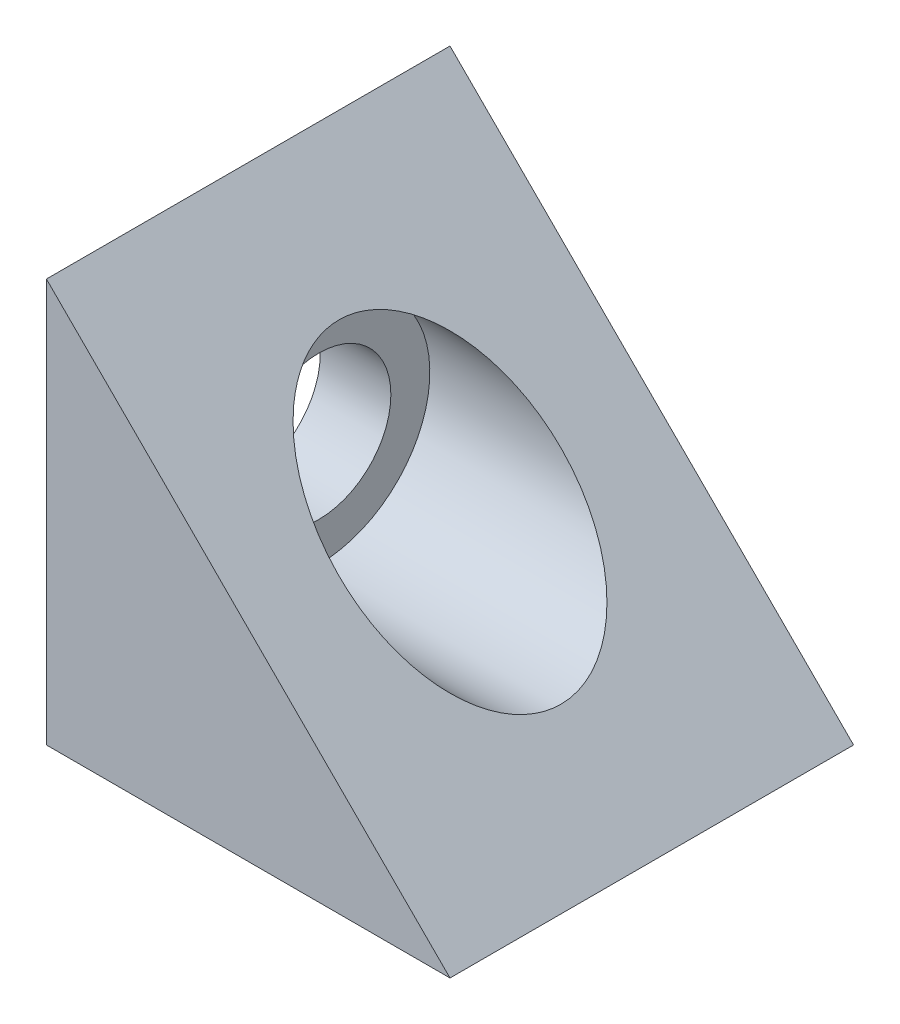
ISO-10303-21;
HEADER;
FILE_DESCRIPTION(('STEP AP214'),'2;1');
FILE_NAME('part.step','',(''),(''),'','','');
FILE_SCHEMA(('AUTOMOTIVE_DESIGN { 1 0 10303 214 1 1 1 1 }'));
ENDSEC;
DATA;
#1=APPLICATION_CONTEXT('core data for automotive mechanical design processes');
#2=APPLICATION_PROTOCOL_DEFINITION('international standard','automotive_design',2000,#1);
#3=PRODUCT_CONTEXT('',#1,'mechanical');
#4=PRODUCT('Part','Part','',(#3));
#5=PRODUCT_RELATED_PRODUCT_CATEGORY('part','',(#4));
#6=PRODUCT_DEFINITION_FORMATION('','',#4);
#7=PRODUCT_DEFINITION_CONTEXT('part definition',#1,'design');
#8=PRODUCT_DEFINITION('design','',#6,#7);
#9=PRODUCT_DEFINITION_SHAPE('','',#8);
#10=(LENGTH_UNIT() NAMED_UNIT(*) SI_UNIT(.MILLI.,.METRE.));
#11=(NAMED_UNIT(*) PLANE_ANGLE_UNIT() SI_UNIT($,.RADIAN.));
#12=(NAMED_UNIT(*) SI_UNIT($,.STERADIAN.) SOLID_ANGLE_UNIT());
#13=UNCERTAINTY_MEASURE_WITH_UNIT(LENGTH_MEASURE(1.E-05),#10,'distance_accuracy_value','');
#14=(GEOMETRIC_REPRESENTATION_CONTEXT(3) GLOBAL_UNCERTAINTY_ASSIGNED_CONTEXT((#13)) GLOBAL_UNIT_ASSIGNED_CONTEXT((#10,
#11,#12)) REPRESENTATION_CONTEXT('',''));
#15=CARTESIAN_POINT('',(0.,0.,0.));
#16=DIRECTION('',(0.,0.,1.));
#17=DIRECTION('',(1.,0.,0.));
#18=AXIS2_PLACEMENT_3D('',#15,#16,#17);
#19=CARTESIAN_POINT('',(20.,0.,-10.));
#20=DIRECTION('',(0.,-1.,0.));
#21=DIRECTION('',(1.,0.,0.));
#22=AXIS2_PLACEMENT_3D('',#19,#20,#21);
#23=PLANE('',#22);
#24=DIRECTION('',(1.,0.,0.));
#25=VECTOR('',#24,1.);
#26=CARTESIAN_POINT('',(20.,0.,10.));
#27=LINE('',#26,#25);
#28=CARTESIAN_POINT('',(0.,0.,10.));
#29=VERTEX_POINT('',#28);
#30=CARTESIAN_POINT('',(20.,0.,10.));
#31=VERTEX_POINT('',#30);
#32=EDGE_CURVE('E91',#29,#31,#27,.T.);
#33=ORIENTED_EDGE('',*,*,#32,.F.);
#34=DIRECTION('',(0.,0.,1.));
#35=VECTOR('',#34,1.);
#36=CARTESIAN_POINT('',(0.,0.,-10.));
#37=LINE('',#36,#35);
#38=CARTESIAN_POINT('',(0.,0.,-10.));
#39=VERTEX_POINT('',#38);
#40=EDGE_CURVE('E12',#39,#29,#37,.T.);
#41=ORIENTED_EDGE('',*,*,#40,.F.);
#42=DIRECTION('',(1.,0.,0.));
#43=VECTOR('',#42,1.);
#44=CARTESIAN_POINT('',(20.,0.,-10.));
#45=LINE('',#44,#43);
#46=CARTESIAN_POINT('',(20.,0.,-10.));
#47=VERTEX_POINT('',#46);
#48=EDGE_CURVE('E80',#39,#47,#45,.T.);
#49=ORIENTED_EDGE('',*,*,#48,.T.);
#50=DIRECTION('',(0.,0.,1.));
#51=VECTOR('',#50,1.);
#52=CARTESIAN_POINT('',(20.,0.,-10.));
#53=LINE('',#52,#51);
#54=EDGE_CURVE('E69',#47,#31,#53,.T.);
#55=ORIENTED_EDGE('',*,*,#54,.T.);
#56=EDGE_LOOP('',(#33,#41,#49,#55));
#57=FACE_BOUND('',#56,.T.);
#58=ADVANCED_FACE('F34',(#57),#23,.T.);
#59=CARTESIAN_POINT('',(0.,0.,-10.));
#60=DIRECTION('',(-1.,0.,0.));
#61=DIRECTION('',(0.,0.,1.));
#62=AXIS2_PLACEMENT_3D('',#59,#60,#61);
#63=PLANE('',#62);
#64=CARTESIAN_POINT('',(0.,10.,0.));
#65=DIRECTION('',(1.,0.,0.));
#66=DIRECTION('',(0.,0.,-1.));
#67=AXIS2_PLACEMENT_3D('',#64,#65,#66);
#68=CIRCLE('',#67,3.57);
#69=CARTESIAN_POINT('',(0.,10.,-3.57));
#70=VERTEX_POINT('',#69);
#71=EDGE_CURVE('E87',#70,#70,#68,.T.);
#72=ORIENTED_EDGE('',*,*,#71,.T.);
#73=EDGE_LOOP('',(#72));
#74=FACE_BOUND('',#73,.T.);
#75=DIRECTION('',(0.,-1.,0.));
#76=VECTOR('',#75,1.);
#77=CARTESIAN_POINT('',(0.,0.,10.));
#78=LINE('',#77,#76);
#79=CARTESIAN_POINT('',(0.,20.,10.));
#80=VERTEX_POINT('',#79);
#81=EDGE_CURVE('E82',#80,#29,#78,.T.);
#82=ORIENTED_EDGE('',*,*,#81,.F.);
#83=DIRECTION('',(0.,0.,1.));
#84=VECTOR('',#83,1.);
#85=CARTESIAN_POINT('',(0.,20.,-10.));
#86=LINE('',#85,#84);
#87=CARTESIAN_POINT('',(0.,20.,-10.));
#88=VERTEX_POINT('',#87);
#89=EDGE_CURVE('E43',#88,#80,#86,.T.);
#90=ORIENTED_EDGE('',*,*,#89,.F.);
#91=DIRECTION('',(0.,-1.,0.));
#92=VECTOR('',#91,1.);
#93=CARTESIAN_POINT('',(0.,0.,-10.));
#94=LINE('',#93,#92);
#95=EDGE_CURVE('E76',#88,#39,#94,.T.);
#96=ORIENTED_EDGE('',*,*,#95,.T.);
#97=ORIENTED_EDGE('',*,*,#40,.T.);
#98=EDGE_LOOP('',(#82,#90,#96,#97));
#99=FACE_BOUND('',#98,.T.);
#100=ADVANCED_FACE('F116',(#74,#99),#63,.T.);
#101=CARTESIAN_POINT('',(0.,20.,-10.));
#102=DIRECTION('',(0.707106781186548,0.707106781186548,0.));
#103=DIRECTION('',(-0.707106781186548,0.707106781186548,0.));
#104=AXIS2_PLACEMENT_3D('',#101,#102,#103);
#105=PLANE('',#104);
#106=CARTESIAN_POINT('',(10.,10.,0.));
#107=DIRECTION('',(0.707106781186548,0.707106781186548,0.));
#108=DIRECTION('',(0.707106781186548,-0.707106781186548,0.));
#109=AXIS2_PLACEMENT_3D('',#106,#107,#108);
#110=ELLIPSE('',#109,7.77817459305202,5.5);
#111=CARTESIAN_POINT('',(15.5,4.5,0.));
#112=VERTEX_POINT('',#111);
#113=EDGE_CURVE('E37',#112,#112,#110,.T.);
#114=ORIENTED_EDGE('',*,*,#113,.F.);
#115=EDGE_LOOP('',(#114));
#116=FACE_BOUND('',#115,.T.);
#117=DIRECTION('',(-0.707106781186548,0.707106781186548,0.));
#118=VECTOR('',#117,1.);
#119=CARTESIAN_POINT('',(0.,20.,10.));
#120=LINE('',#119,#118);
#121=EDGE_CURVE('E74',#31,#80,#120,.T.);
#122=ORIENTED_EDGE('',*,*,#121,.F.);
#123=ORIENTED_EDGE('',*,*,#54,.F.);
#124=DIRECTION('',(-0.707106781186548,0.707106781186548,0.));
#125=VECTOR('',#124,1.);
#126=CARTESIAN_POINT('',(0.,20.,-10.));
#127=LINE('',#126,#125);
#128=EDGE_CURVE('E72',#47,#88,#127,.T.);
#129=ORIENTED_EDGE('',*,*,#128,.T.);
#130=ORIENTED_EDGE('',*,*,#89,.T.);
#131=EDGE_LOOP('',(#122,#123,#129,#130));
#132=FACE_BOUND('',#131,.T.);
#133=ADVANCED_FACE('F71',(#116,#132),#105,.T.);
#134=CARTESIAN_POINT('',(0.,0.,-10.));
#135=DIRECTION('',(0.,0.,-1.));
#136=DIRECTION('',(-1.,0.,0.));
#137=AXIS2_PLACEMENT_3D('',#134,#135,#136);
#138=PLANE('',#137);
#139=ORIENTED_EDGE('',*,*,#48,.F.);
#140=ORIENTED_EDGE('',*,*,#95,.F.);
#141=ORIENTED_EDGE('',*,*,#128,.F.);
#142=EDGE_LOOP('',(#139,#140,#141));
#143=FACE_BOUND('',#142,.T.);
#144=ADVANCED_FACE('F79',(#143),#138,.T.);
#145=CARTESIAN_POINT('',(0.,0.,10.));
#146=DIRECTION('',(0.,0.,-1.));
#147=DIRECTION('',(-1.,0.,0.));
#148=AXIS2_PLACEMENT_3D('',#145,#146,#147);
#149=PLANE('',#148);
#150=ORIENTED_EDGE('',*,*,#32,.T.);
#151=ORIENTED_EDGE('',*,*,#121,.T.);
#152=ORIENTED_EDGE('',*,*,#81,.T.);
#153=EDGE_LOOP('',(#150,#151,#152));
#154=FACE_BOUND('',#153,.T.);
#155=ADVANCED_FACE('F128',(#154),#149,.F.);
#156=CARTESIAN_POINT('',(0.,10.,0.));
#157=DIRECTION('',(1.,0.,0.));
#158=DIRECTION('',(0.,0.,-1.));
#159=AXIS2_PLACEMENT_3D('',#156,#157,#158);
#160=CYLINDRICAL_SURFACE('',#159,3.57);
#161=CARTESIAN_POINT('',(3.5,10.,0.));
#162=DIRECTION('',(-1.,0.,0.));
#163=DIRECTION('',(0.,0.,1.));
#164=AXIS2_PLACEMENT_3D('',#161,#162,#163);
#165=CIRCLE('',#164,3.57);
#166=CARTESIAN_POINT('',(3.5,10.,3.57));
#167=VERTEX_POINT('',#166);
#168=EDGE_CURVE('E94',#167,#167,#165,.F.);
#169=ORIENTED_EDGE('',*,*,#168,.T.);
#170=EDGE_LOOP('',(#169));
#171=FACE_BOUND('',#170,.T.);
#172=ORIENTED_EDGE('',*,*,#71,.F.);
#173=EDGE_LOOP('',(#172));
#174=FACE_BOUND('',#173,.T.);
#175=ADVANCED_FACE('F113',(#171,#174),#160,.F.);
#176=CARTESIAN_POINT('',(3.5,0.,-10.));
#177=DIRECTION('',(-1.,0.,0.));
#178=DIRECTION('',(0.,0.,1.));
#179=AXIS2_PLACEMENT_3D('',#176,#177,#178);
#180=PLANE('',#179);
#181=CARTESIAN_POINT('',(3.5,10.,0.));
#182=DIRECTION('',(-1.,0.,0.));
#183=DIRECTION('',(0.,0.,1.));
#184=AXIS2_PLACEMENT_3D('',#181,#182,#183);
#185=CIRCLE('',#184,5.5);
#186=CARTESIAN_POINT('',(3.5,10.,5.5));
#187=VERTEX_POINT('',#186);
#188=EDGE_CURVE('E96',#187,#187,#185,.F.);
#189=ORIENTED_EDGE('',*,*,#188,.T.);
#190=EDGE_LOOP('',(#189));
#191=FACE_BOUND('',#190,.T.);
#192=ORIENTED_EDGE('',*,*,#168,.F.);
#193=EDGE_LOOP('',(#192));
#194=FACE_BOUND('',#193,.T.);
#195=ADVANCED_FACE('F103',(#191,#194),#180,.F.);
#196=CARTESIAN_POINT('',(-15.556349186104,10.,0.));
#197=DIRECTION('',(1.,0.,0.));
#198=DIRECTION('',(0.,0.,-1.));
#199=AXIS2_PLACEMENT_3D('',#196,#197,#198);
#200=CYLINDRICAL_SURFACE('',#199,5.5);
#201=ORIENTED_EDGE('',*,*,#113,.T.);
#202=EDGE_LOOP('',(#201));
#203=FACE_BOUND('',#202,.T.);
#204=ORIENTED_EDGE('',*,*,#188,.F.);
#205=EDGE_LOOP('',(#204));
#206=FACE_BOUND('',#205,.T.);
#207=ADVANCED_FACE('F106',(#203,#206),#200,.F.);
#208=CLOSED_SHELL('',(#58,#100,#133,#144,#155,#175,#195,#207));
#209=MANIFOLD_SOLID_BREP('B2',#208);
#210=ADVANCED_BREP_SHAPE_REPRESENTATION('',(#18,#209),#14);
#211=SHAPE_DEFINITION_REPRESENTATION(#9,#210);
ENDSEC;
END-ISO-10303-21;
